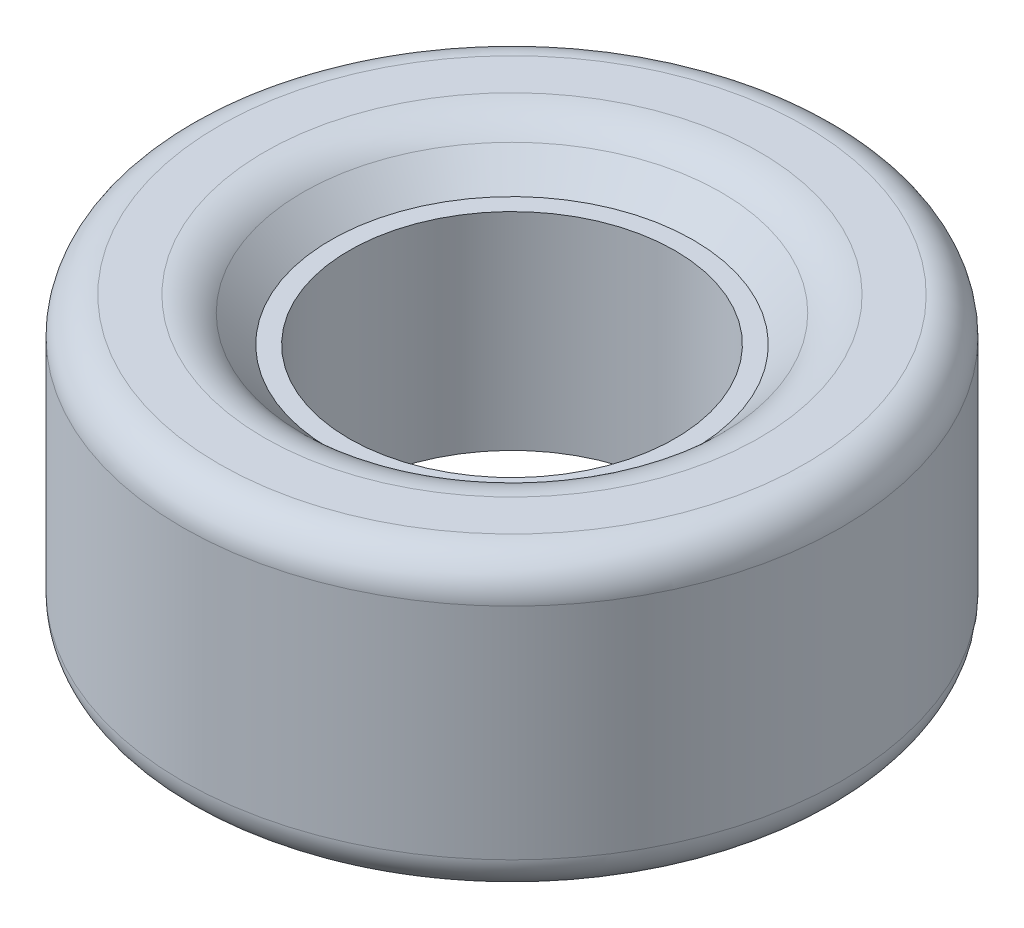
ISO-10303-21;
HEADER;
FILE_DESCRIPTION(('STEP AP214'),'2;1');
FILE_NAME('part.step','',(''),(''),'','','');
FILE_SCHEMA(('AUTOMOTIVE_DESIGN { 1 0 10303 214 1 1 1 1 }'));
ENDSEC;
DATA;
#1=APPLICATION_CONTEXT('core data for automotive mechanical design processes');
#2=APPLICATION_PROTOCOL_DEFINITION('international standard','automotive_design',2000,#1);
#3=PRODUCT_CONTEXT('',#1,'mechanical');
#4=PRODUCT('Part','Part','',(#3));
#5=PRODUCT_RELATED_PRODUCT_CATEGORY('part','',(#4));
#6=PRODUCT_DEFINITION_FORMATION('','',#4);
#7=PRODUCT_DEFINITION_CONTEXT('part definition',#1,'design');
#8=PRODUCT_DEFINITION('design','',#6,#7);
#9=PRODUCT_DEFINITION_SHAPE('','',#8);
#10=(LENGTH_UNIT() NAMED_UNIT(*) SI_UNIT(.MILLI.,.METRE.));
#11=(NAMED_UNIT(*) PLANE_ANGLE_UNIT() SI_UNIT($,.RADIAN.));
#12=(NAMED_UNIT(*) SI_UNIT($,.STERADIAN.) SOLID_ANGLE_UNIT());
#13=UNCERTAINTY_MEASURE_WITH_UNIT(LENGTH_MEASURE(1.E-05),#10,'distance_accuracy_value','');
#14=(GEOMETRIC_REPRESENTATION_CONTEXT(3) GLOBAL_UNCERTAINTY_ASSIGNED_CONTEXT((#13)) GLOBAL_UNIT_ASSIGNED_CONTEXT((#10,
#11,#12)) REPRESENTATION_CONTEXT('',''));
#15=CARTESIAN_POINT('',(0.,0.,0.));
#16=DIRECTION('',(0.,0.,1.));
#17=DIRECTION('',(1.,0.,0.));
#18=AXIS2_PLACEMENT_3D('',#15,#16,#17);
#19=CARTESIAN_POINT('',(0.,80.,0.));
#20=DIRECTION('',(0.,1.,0.));
#21=DIRECTION('',(0.,0.,1.));
#22=AXIS2_PLACEMENT_3D('',#19,#20,#21);
#23=PLANE('',#22);
#24=CARTESIAN_POINT('',(0.,80.,0.));
#25=DIRECTION('',(0.,1.,0.));
#26=DIRECTION('',(0.,0.,1.));
#27=AXIS2_PLACEMENT_3D('',#24,#25,#26);
#28=CIRCLE('',#27,80.);
#29=CARTESIAN_POINT('',(0.,80.,80.));
#30=VERTEX_POINT('',#29);
#31=EDGE_CURVE('E10',#30,#30,#28,.T.);
#32=ORIENTED_EDGE('',*,*,#31,.T.);
#33=EDGE_LOOP('',(#32));
#34=FACE_BOUND('',#33,.T.);
#35=CARTESIAN_POINT('',(0.,80.,0.));
#36=DIRECTION('',(0.,1.,0.));
#37=DIRECTION('',(0.,0.,1.));
#38=AXIS2_PLACEMENT_3D('',#35,#36,#37);
#39=CIRCLE('',#38,67.6209145928533);
#40=CARTESIAN_POINT('',(0.,80.,67.6209145928533));
#41=VERTEX_POINT('',#40);
#42=EDGE_CURVE('E54',#41,#41,#39,.F.);
#43=ORIENTED_EDGE('',*,*,#42,.T.);
#44=EDGE_LOOP('',(#43));
#45=FACE_BOUND('',#44,.T.);
#46=ADVANCED_FACE('F31',(#34,#45),#23,.T.);
#47=CARTESIAN_POINT('',(0.,0.,0.));
#48=DIRECTION('',(0.,1.,0.));
#49=DIRECTION('',(0.,0.,1.));
#50=AXIS2_PLACEMENT_3D('',#47,#48,#49);
#51=PLANE('',#50);
#52=CARTESIAN_POINT('',(0.,0.,0.));
#53=DIRECTION('',(0.,1.,0.));
#54=DIRECTION('',(0.,0.,1.));
#55=AXIS2_PLACEMENT_3D('',#52,#53,#54);
#56=CIRCLE('',#55,80.);
#57=CARTESIAN_POINT('',(0.,0.,80.));
#58=VERTEX_POINT('',#57);
#59=EDGE_CURVE('E38',#58,#58,#56,.F.);
#60=ORIENTED_EDGE('',*,*,#59,.T.);
#61=EDGE_LOOP('',(#60));
#62=FACE_BOUND('',#61,.T.);
#63=CARTESIAN_POINT('',(0.,0.,0.));
#64=DIRECTION('',(0.,1.,0.));
#65=DIRECTION('',(0.,0.,1.));
#66=AXIS2_PLACEMENT_3D('',#63,#64,#65);
#67=CIRCLE('',#66,67.6209145928533);
#68=CARTESIAN_POINT('',(0.,0.,67.6209145928533));
#69=VERTEX_POINT('',#68);
#70=EDGE_CURVE('E57',#69,#69,#67,.T.);
#71=ORIENTED_EDGE('',*,*,#70,.T.);
#72=EDGE_LOOP('',(#71));
#73=FACE_BOUND('',#72,.T.);
#74=ADVANCED_FACE('F94',(#62,#73),#51,.F.);
#75=CARTESIAN_POINT('',(0.,80.,0.));
#76=DIRECTION('',(0.,-1.,0.));
#77=DIRECTION('',(0.,0.,-1.));
#78=AXIS2_PLACEMENT_3D('',#75,#76,#77);
#79=CYLINDRICAL_SURFACE('',#78,90.);
#80=CARTESIAN_POINT('',(0.,9.99999999999999,0.));
#81=DIRECTION('',(0.,1.,0.));
#82=DIRECTION('',(0.,0.,1.));
#83=AXIS2_PLACEMENT_3D('',#80,#81,#82);
#84=CIRCLE('',#83,90.);
#85=CARTESIAN_POINT('',(0.,9.99999999999999,90.));
#86=VERTEX_POINT('',#85);
#87=EDGE_CURVE('E42',#86,#86,#84,.T.);
#88=ORIENTED_EDGE('',*,*,#87,.T.);
#89=EDGE_LOOP('',(#88));
#90=FACE_BOUND('',#89,.T.);
#91=CARTESIAN_POINT('',(0.,70.,0.));
#92=DIRECTION('',(0.,1.,0.));
#93=DIRECTION('',(0.,0.,1.));
#94=AXIS2_PLACEMENT_3D('',#91,#92,#93);
#95=CIRCLE('',#94,90.);
#96=CARTESIAN_POINT('',(0.,70.,90.));
#97=VERTEX_POINT('',#96);
#98=EDGE_CURVE('E46',#97,#97,#95,.F.);
#99=ORIENTED_EDGE('',*,*,#98,.T.);
#100=EDGE_LOOP('',(#99));
#101=FACE_BOUND('',#100,.T.);
#102=ADVANCED_FACE('F100',(#90,#101),#79,.T.);
#103=CARTESIAN_POINT('',(0.,80.,0.));
#104=DIRECTION('',(0.,-1.,0.));
#105=DIRECTION('',(0.,0.,-1.));
#106=AXIS2_PLACEMENT_3D('',#103,#104,#105);
#107=CYLINDRICAL_SURFACE('',#106,44.5);
#108=CARTESIAN_POINT('',(0.,68.25,0.));
#109=DIRECTION('',(0.,-1.,0.));
#110=DIRECTION('',(0.,0.,-1.));
#111=AXIS2_PLACEMENT_3D('',#108,#109,#110);
#112=CIRCLE('',#111,44.5);
#113=CARTESIAN_POINT('',(0.,68.25,-44.5));
#114=VERTEX_POINT('',#113);
#115=EDGE_CURVE('E69',#114,#114,#112,.T.);
#116=ORIENTED_EDGE('',*,*,#115,.F.);
#117=EDGE_LOOP('',(#116));
#118=FACE_BOUND('',#117,.T.);
#119=CARTESIAN_POINT('',(0.,11.75,0.));
#120=DIRECTION('',(0.,-1.,0.));
#121=DIRECTION('',(0.,0.,-1.));
#122=AXIS2_PLACEMENT_3D('',#119,#120,#121);
#123=CIRCLE('',#122,44.5);
#124=CARTESIAN_POINT('',(0.,11.75,-44.5));
#125=VERTEX_POINT('',#124);
#126=EDGE_CURVE('E63',#125,#125,#123,.T.);
#127=ORIENTED_EDGE('',*,*,#126,.T.);
#128=EDGE_LOOP('',(#127));
#129=FACE_BOUND('',#128,.T.);
#130=ADVANCED_FACE('F104',(#118,#129),#107,.F.);
#131=CARTESIAN_POINT('',(49.5,11.75,0.));
#132=DIRECTION('',(0.,1.,0.));
#133=DIRECTION('',(0.,0.,1.));
#134=AXIS2_PLACEMENT_3D('',#131,#132,#133);
#135=PLANE('',#134);
#136=ORIENTED_EDGE('',*,*,#126,.F.);
#137=EDGE_LOOP('',(#136));
#138=FACE_BOUND('',#137,.T.);
#139=CARTESIAN_POINT('',(0.,11.75,0.));
#140=DIRECTION('',(0.,-1.,0.));
#141=DIRECTION('',(0.,0.,-1.));
#142=AXIS2_PLACEMENT_3D('',#139,#140,#141);
#143=CIRCLE('',#142,49.5);
#144=CARTESIAN_POINT('',(0.,11.75,-49.5));
#145=VERTEX_POINT('',#144);
#146=EDGE_CURVE('E66',#145,#145,#143,.T.);
#147=ORIENTED_EDGE('',*,*,#146,.T.);
#148=EDGE_LOOP('',(#147));
#149=FACE_BOUND('',#148,.T.);
#150=ADVANCED_FACE('F90',(#138,#149),#135,.F.);
#151=CARTESIAN_POINT('',(0.,0.,0.));
#152=DIRECTION('',(0.,-1.,0.));
#153=DIRECTION('',(0.,0.,-1.));
#154=AXIS2_PLACEMENT_3D('',#151,#152,#153);
#155=CONICAL_SURFACE('',#154,61.5,0.795924090429174);
#156=CARTESIAN_POINT('',(0.,4.28234360259758,0.));
#157=DIRECTION('',(0.,1.,0.));
#158=DIRECTION('',(0.,0.,1.));
#159=AXIS2_PLACEMENT_3D('',#156,#157,#158);
#160=CIRCLE('',#159,57.1265427037301);
#161=CARTESIAN_POINT('',(0.,4.28234360259758,57.1265427037301));
#162=VERTEX_POINT('',#161);
#163=EDGE_CURVE('E60',#162,#162,#160,.F.);
#164=ORIENTED_EDGE('',*,*,#163,.T.);
#165=EDGE_LOOP('',(#164));
#166=FACE_BOUND('',#165,.T.);
#167=ORIENTED_EDGE('',*,*,#146,.F.);
#168=EDGE_LOOP('',(#167));
#169=FACE_BOUND('',#168,.T.);
#170=ADVANCED_FACE('F80',(#166,#169),#155,.F.);
#171=CARTESIAN_POINT('',(49.5,68.25,0.));
#172=DIRECTION('',(0.,-1.,0.));
#173=DIRECTION('',(0.,0.,1.));
#174=AXIS2_PLACEMENT_3D('',#171,#172,#173);
#175=PLANE('',#174);
#176=ORIENTED_EDGE('',*,*,#115,.T.);
#177=EDGE_LOOP('',(#176));
#178=FACE_BOUND('',#177,.T.);
#179=CARTESIAN_POINT('',(0.,68.25,0.));
#180=DIRECTION('',(0.,-1.,0.));
#181=DIRECTION('',(0.,0.,-1.));
#182=AXIS2_PLACEMENT_3D('',#179,#180,#181);
#183=CIRCLE('',#182,49.5);
#184=CARTESIAN_POINT('',(0.,68.25,-49.5));
#185=VERTEX_POINT('',#184);
#186=EDGE_CURVE('E72',#185,#185,#183,.T.);
#187=ORIENTED_EDGE('',*,*,#186,.F.);
#188=EDGE_LOOP('',(#187));
#189=FACE_BOUND('',#188,.T.);
#190=ADVANCED_FACE('F78',(#178,#189),#175,.F.);
#191=CARTESIAN_POINT('',(0.,80.,0.));
#192=DIRECTION('',(0.,1.,0.));
#193=DIRECTION('',(0.,0.,-1.));
#194=AXIS2_PLACEMENT_3D('',#191,#192,#193);
#195=CONICAL_SURFACE('',#194,61.5,0.795924090429174);
#196=CARTESIAN_POINT('',(0.,75.7176563974024,0.));
#197=DIRECTION('',(0.,1.,0.));
#198=DIRECTION('',(0.,0.,1.));
#199=AXIS2_PLACEMENT_3D('',#196,#197,#198);
#200=CIRCLE('',#199,57.1265427037301);
#201=CARTESIAN_POINT('',(0.,75.7176563974024,57.1265427037301));
#202=VERTEX_POINT('',#201);
#203=EDGE_CURVE('E51',#202,#202,#200,.T.);
#204=ORIENTED_EDGE('',*,*,#203,.T.);
#205=EDGE_LOOP('',(#204));
#206=FACE_BOUND('',#205,.T.);
#207=ORIENTED_EDGE('',*,*,#186,.T.);
#208=EDGE_LOOP('',(#207));
#209=FACE_BOUND('',#208,.T.);
#210=ADVANCED_FACE('F76',(#206,#209),#195,.F.);
#211=CARTESIAN_POINT('',(0.,15.,0.));
#212=DIRECTION('',(0.,1.,0.));
#213=DIRECTION('',(0.,0.,1.));
#214=AXIS2_PLACEMENT_3D('',#211,#212,#213);
#215=TOROIDAL_SURFACE('',#214,67.6209145928533,15.);
#216=ORIENTED_EDGE('',*,*,#70,.F.);
#217=EDGE_LOOP('',(#216));
#218=FACE_BOUND('',#217,.T.);
#219=ORIENTED_EDGE('',*,*,#163,.F.);
#220=EDGE_LOOP('',(#219));
#221=FACE_BOUND('',#220,.T.);
#222=ADVANCED_FACE('F87',(#218,#221),#215,.T.);
#223=CARTESIAN_POINT('',(0.,65.,0.));
#224=DIRECTION('',(0.,1.,0.));
#225=DIRECTION('',(0.,0.,1.));
#226=AXIS2_PLACEMENT_3D('',#223,#224,#225);
#227=TOROIDAL_SURFACE('',#226,67.6209145928533,15.);
#228=ORIENTED_EDGE('',*,*,#203,.F.);
#229=EDGE_LOOP('',(#228));
#230=FACE_BOUND('',#229,.T.);
#231=ORIENTED_EDGE('',*,*,#42,.F.);
#232=EDGE_LOOP('',(#231));
#233=FACE_BOUND('',#232,.T.);
#234=ADVANCED_FACE('F112',(#230,#233),#227,.T.);
#235=CARTESIAN_POINT('',(0.,9.99999999999999,0.));
#236=DIRECTION('',(0.,1.,0.));
#237=DIRECTION('',(0.,0.,1.));
#238=AXIS2_PLACEMENT_3D('',#235,#236,#237);
#239=TOROIDAL_SURFACE('',#238,80.,10.);
#240=ORIENTED_EDGE('',*,*,#59,.F.);
#241=EDGE_LOOP('',(#240));
#242=FACE_BOUND('',#241,.T.);
#243=ORIENTED_EDGE('',*,*,#87,.F.);
#244=EDGE_LOOP('',(#243));
#245=FACE_BOUND('',#244,.T.);
#246=ADVANCED_FACE('F115',(#242,#245),#239,.T.);
#247=CARTESIAN_POINT('',(0.,70.,0.));
#248=DIRECTION('',(0.,1.,0.));
#249=DIRECTION('',(0.,0.,1.));
#250=AXIS2_PLACEMENT_3D('',#247,#248,#249);
#251=TOROIDAL_SURFACE('',#250,80.,10.);
#252=ORIENTED_EDGE('',*,*,#98,.F.);
#253=EDGE_LOOP('',(#252));
#254=FACE_BOUND('',#253,.T.);
#255=ORIENTED_EDGE('',*,*,#31,.F.);
#256=EDGE_LOOP('',(#255));
#257=FACE_BOUND('',#256,.T.);
#258=ADVANCED_FACE('F33',(#254,#257),#251,.T.);
#259=CLOSED_SHELL('',(#46,#74,#102,#130,#150,#170,#190,#210,#222,#234,#246,#258));
#260=MANIFOLD_SOLID_BREP('B2',#259);
#261=ADVANCED_BREP_SHAPE_REPRESENTATION('',(#18,#260),#14);
#262=SHAPE_DEFINITION_REPRESENTATION(#9,#261);
ENDSEC;
END-ISO-10303-21;
